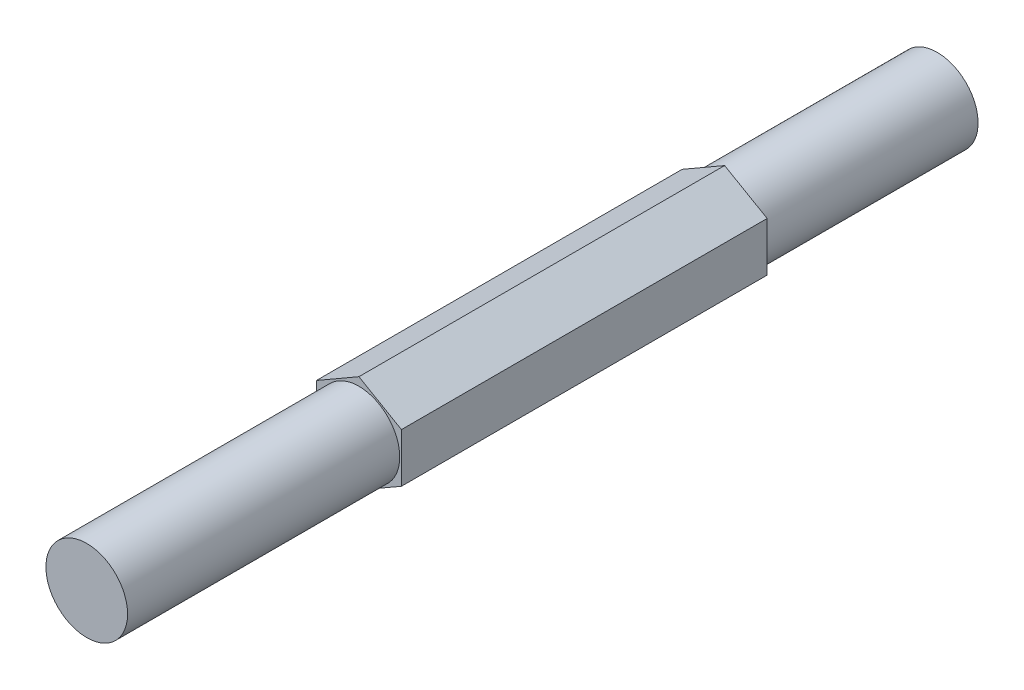
ISO-10303-21;
HEADER;
FILE_DESCRIPTION(('STEP AP214'),'2;1');
FILE_NAME('part.step','',(''),(''),'','','');
FILE_SCHEMA(('AUTOMOTIVE_DESIGN { 1 0 10303 214 1 1 1 1 }'));
ENDSEC;
DATA;
#1=APPLICATION_CONTEXT('core data for automotive mechanical design processes');
#2=APPLICATION_PROTOCOL_DEFINITION('international standard','automotive_design',2000,#1);
#3=PRODUCT_CONTEXT('',#1,'mechanical');
#4=PRODUCT('Part','Part','',(#3));
#5=PRODUCT_RELATED_PRODUCT_CATEGORY('part','',(#4));
#6=PRODUCT_DEFINITION_FORMATION('','',#4);
#7=PRODUCT_DEFINITION_CONTEXT('part definition',#1,'design');
#8=PRODUCT_DEFINITION('design','',#6,#7);
#9=PRODUCT_DEFINITION_SHAPE('','',#8);
#10=(LENGTH_UNIT() NAMED_UNIT(*) SI_UNIT(.MILLI.,.METRE.));
#11=(NAMED_UNIT(*) PLANE_ANGLE_UNIT() SI_UNIT($,.RADIAN.));
#12=(NAMED_UNIT(*) SI_UNIT($,.STERADIAN.) SOLID_ANGLE_UNIT());
#13=UNCERTAINTY_MEASURE_WITH_UNIT(LENGTH_MEASURE(1.E-05),#10,'distance_accuracy_value','');
#14=(GEOMETRIC_REPRESENTATION_CONTEXT(3) GLOBAL_UNCERTAINTY_ASSIGNED_CONTEXT((#13)) GLOBAL_UNIT_ASSIGNED_CONTEXT((#10,
#11,#12)) REPRESENTATION_CONTEXT('',''));
#15=CARTESIAN_POINT('',(0.,0.,0.));
#16=DIRECTION('',(0.,0.,1.));
#17=DIRECTION('',(1.,0.,0.));
#18=AXIS2_PLACEMENT_3D('',#15,#16,#17);
#19=CARTESIAN_POINT('',(3.17499999999998,1.83308710467707,63.5));
#20=DIRECTION('',(-0.5,-0.866025403784439,0.));
#21=DIRECTION('',(0.866025403784439,-0.5,0.));
#22=AXIS2_PLACEMENT_3D('',#19,#20,#21);
#23=PLANE('',#22);
#24=DIRECTION('',(0.866025403784439,-0.5,0.));
#25=VECTOR('',#24,1.);
#26=CARTESIAN_POINT('',(3.17499999999998,1.83308710467707,15.875));
#27=LINE('',#26,#25);
#28=CARTESIAN_POINT('',(0.,3.66617420935412,15.875));
#29=VERTEX_POINT('',#28);
#30=CARTESIAN_POINT('',(3.17499999999998,1.83308710467707,15.875));
#31=VERTEX_POINT('',#30);
#32=EDGE_CURVE('E47',#29,#31,#27,.T.);
#33=ORIENTED_EDGE('',*,*,#32,.F.);
#34=DIRECTION('',(0.,0.,-1.));
#35=VECTOR('',#34,1.);
#36=CARTESIAN_POINT('',(0.,3.66617420935412,63.5));
#37=LINE('',#36,#35);
#38=CARTESIAN_POINT('',(0.,3.66617420935412,43.18));
#39=VERTEX_POINT('',#38);
#40=EDGE_CURVE('E114',#39,#29,#37,.T.);
#41=ORIENTED_EDGE('',*,*,#40,.F.);
#42=DIRECTION('',(-0.866025403784439,0.5,0.));
#43=VECTOR('',#42,1.);
#44=CARTESIAN_POINT('',(3.17499999999998,1.83308710467707,43.18));
#45=LINE('',#44,#43);
#46=CARTESIAN_POINT('',(3.17499999999998,1.83308710467707,43.18));
#47=VERTEX_POINT('',#46);
#48=EDGE_CURVE('E105',#47,#39,#45,.T.);
#49=ORIENTED_EDGE('',*,*,#48,.F.);
#50=DIRECTION('',(0.,0.,-1.));
#51=VECTOR('',#50,1.);
#52=CARTESIAN_POINT('',(3.17499999999998,1.83308710467707,63.5));
#53=LINE('',#52,#51);
#54=EDGE_CURVE('E101',#47,#31,#53,.T.);
#55=ORIENTED_EDGE('',*,*,#54,.T.);
#56=EDGE_LOOP('',(#33,#41,#49,#55));
#57=FACE_BOUND('',#56,.T.);
#58=ADVANCED_FACE('F34',(#57),#23,.F.);
#59=CARTESIAN_POINT('',(0.,3.66617420935412,63.5));
#60=DIRECTION('',(0.499999999999999,-0.866025403784439,0.));
#61=DIRECTION('',(0.866025403784439,0.499999999999999,0.));
#62=AXIS2_PLACEMENT_3D('',#59,#60,#61);
#63=PLANE('',#62);
#64=DIRECTION('',(0.866025403784439,0.499999999999999,0.));
#65=VECTOR('',#64,1.);
#66=CARTESIAN_POINT('',(0.,3.66617420935412,15.875));
#67=LINE('',#66,#65);
#68=CARTESIAN_POINT('',(-3.17500000000001,1.83308710467706,15.875));
#69=VERTEX_POINT('',#68);
#70=EDGE_CURVE('E136',#69,#29,#67,.T.);
#71=ORIENTED_EDGE('',*,*,#70,.F.);
#72=DIRECTION('',(0.,0.,-1.));
#73=VECTOR('',#72,1.);
#74=CARTESIAN_POINT('',(-3.17500000000001,1.83308710467706,63.5));
#75=LINE('',#74,#73);
#76=CARTESIAN_POINT('',(-3.17500000000001,1.83308710467706,43.18));
#77=VERTEX_POINT('',#76);
#78=EDGE_CURVE('E111',#77,#69,#75,.T.);
#79=ORIENTED_EDGE('',*,*,#78,.F.);
#80=DIRECTION('',(-0.866025403784439,-0.499999999999999,0.));
#81=VECTOR('',#80,1.);
#82=CARTESIAN_POINT('',(0.,3.66617420935412,43.18));
#83=LINE('',#82,#81);
#84=EDGE_CURVE('E121',#39,#77,#83,.T.);
#85=ORIENTED_EDGE('',*,*,#84,.F.);
#86=ORIENTED_EDGE('',*,*,#40,.T.);
#87=EDGE_LOOP('',(#71,#79,#85,#86));
#88=FACE_BOUND('',#87,.T.);
#89=ADVANCED_FACE('F164',(#88),#63,.F.);
#90=CARTESIAN_POINT('',(-3.17500000000001,1.83308710467706,63.5));
#91=DIRECTION('',(1.,0.,0.));
#92=DIRECTION('',(0.,0.,-1.));
#93=AXIS2_PLACEMENT_3D('',#90,#91,#92);
#94=PLANE('',#93);
#95=DIRECTION('',(0.,1.,0.));
#96=VECTOR('',#95,1.);
#97=CARTESIAN_POINT('',(-3.17500000000001,1.83308710467706,15.875));
#98=LINE('',#97,#96);
#99=CARTESIAN_POINT('',(-3.17500000000001,-1.83308710467706,15.875));
#100=VERTEX_POINT('',#99);
#101=EDGE_CURVE('E138',#100,#69,#98,.T.);
#102=ORIENTED_EDGE('',*,*,#101,.F.);
#103=DIRECTION('',(0.,0.,-1.));
#104=VECTOR('',#103,1.);
#105=CARTESIAN_POINT('',(-3.17500000000001,-1.83308710467706,63.5));
#106=LINE('',#105,#104);
#107=CARTESIAN_POINT('',(-3.17500000000001,-1.83308710467706,43.18));
#108=VERTEX_POINT('',#107);
#109=EDGE_CURVE('E103',#108,#100,#106,.T.);
#110=ORIENTED_EDGE('',*,*,#109,.F.);
#111=DIRECTION('',(0.,-1.,0.));
#112=VECTOR('',#111,1.);
#113=CARTESIAN_POINT('',(-3.17500000000001,1.83308710467706,43.18));
#114=LINE('',#113,#112);
#115=EDGE_CURVE('E122',#77,#108,#114,.T.);
#116=ORIENTED_EDGE('',*,*,#115,.F.);
#117=ORIENTED_EDGE('',*,*,#78,.T.);
#118=EDGE_LOOP('',(#102,#110,#116,#117));
#119=FACE_BOUND('',#118,.T.);
#120=ADVANCED_FACE('F168',(#119),#94,.F.);
#121=CARTESIAN_POINT('',(-3.17500000000001,-1.83308710467706,63.5));
#122=DIRECTION('',(0.500000000000001,0.866025403784438,0.));
#123=DIRECTION('',(-0.866025403784438,0.500000000000001,0.));
#124=AXIS2_PLACEMENT_3D('',#121,#122,#123);
#125=PLANE('',#124);
#126=DIRECTION('',(-0.866025403784438,0.500000000000001,0.));
#127=VECTOR('',#126,1.);
#128=CARTESIAN_POINT('',(-3.17500000000001,-1.83308710467706,15.875));
#129=LINE('',#128,#127);
#130=CARTESIAN_POINT('',(0.,-3.66617420935412,15.875));
#131=VERTEX_POINT('',#130);
#132=EDGE_CURVE('E97',#131,#100,#129,.T.);
#133=ORIENTED_EDGE('',*,*,#132,.F.);
#134=DIRECTION('',(0.,0.,-1.));
#135=VECTOR('',#134,1.);
#136=CARTESIAN_POINT('',(0.,-3.66617420935412,63.5));
#137=LINE('',#136,#135);
#138=CARTESIAN_POINT('',(0.,-3.66617420935412,43.18));
#139=VERTEX_POINT('',#138);
#140=EDGE_CURVE('E96',#139,#131,#137,.T.);
#141=ORIENTED_EDGE('',*,*,#140,.F.);
#142=DIRECTION('',(0.866025403784438,-0.500000000000001,0.));
#143=VECTOR('',#142,1.);
#144=CARTESIAN_POINT('',(-3.17500000000001,-1.83308710467706,43.18));
#145=LINE('',#144,#143);
#146=EDGE_CURVE('E126',#108,#139,#145,.T.);
#147=ORIENTED_EDGE('',*,*,#146,.F.);
#148=ORIENTED_EDGE('',*,*,#109,.T.);
#149=EDGE_LOOP('',(#133,#141,#147,#148));
#150=FACE_BOUND('',#149,.T.);
#151=ADVANCED_FACE('F173',(#150),#125,.F.);
#152=CARTESIAN_POINT('',(0.,-3.66617420935412,63.5));
#153=DIRECTION('',(-0.5,0.866025403784439,0.));
#154=DIRECTION('',(-0.866025403784439,-0.5,0.));
#155=AXIS2_PLACEMENT_3D('',#152,#153,#154);
#156=PLANE('',#155);
#157=DIRECTION('',(-0.866025403784439,-0.5,0.));
#158=VECTOR('',#157,1.);
#159=CARTESIAN_POINT('',(0.,-3.66617420935412,15.875));
#160=LINE('',#159,#158);
#161=CARTESIAN_POINT('',(3.17499999999998,-1.83308710467706,15.875));
#162=VERTEX_POINT('',#161);
#163=EDGE_CURVE('E84',#162,#131,#160,.T.);
#164=ORIENTED_EDGE('',*,*,#163,.F.);
#165=DIRECTION('',(0.,0.,-1.));
#166=VECTOR('',#165,1.);
#167=CARTESIAN_POINT('',(3.17499999999998,-1.83308710467706,63.5));
#168=LINE('',#167,#166);
#169=CARTESIAN_POINT('',(3.17499999999998,-1.83308710467706,43.18));
#170=VERTEX_POINT('',#169);
#171=EDGE_CURVE('E94',#170,#162,#168,.T.);
#172=ORIENTED_EDGE('',*,*,#171,.F.);
#173=DIRECTION('',(0.866025403784439,0.5,0.));
#174=VECTOR('',#173,1.);
#175=CARTESIAN_POINT('',(0.,-3.66617420935412,43.18));
#176=LINE('',#175,#174);
#177=EDGE_CURVE('E55',#139,#170,#176,.T.);
#178=ORIENTED_EDGE('',*,*,#177,.F.);
#179=ORIENTED_EDGE('',*,*,#140,.T.);
#180=EDGE_LOOP('',(#164,#172,#178,#179));
#181=FACE_BOUND('',#180,.T.);
#182=ADVANCED_FACE('F93',(#181),#156,.F.);
#183=CARTESIAN_POINT('',(3.17499999999998,-1.83308710467706,63.5));
#184=DIRECTION('',(-1.,0.,0.));
#185=DIRECTION('',(0.,0.,1.));
#186=AXIS2_PLACEMENT_3D('',#183,#184,#185);
#187=PLANE('',#186);
#188=DIRECTION('',(0.,-1.,0.));
#189=VECTOR('',#188,1.);
#190=CARTESIAN_POINT('',(3.17499999999998,-1.83308710467706,15.875));
#191=LINE('',#190,#189);
#192=EDGE_CURVE('E12',#31,#162,#191,.T.);
#193=ORIENTED_EDGE('',*,*,#192,.F.);
#194=ORIENTED_EDGE('',*,*,#54,.F.);
#195=DIRECTION('',(0.,1.,0.));
#196=VECTOR('',#195,1.);
#197=CARTESIAN_POINT('',(3.17499999999998,-1.83308710467706,43.18));
#198=LINE('',#197,#196);
#199=EDGE_CURVE('E41',#170,#47,#198,.T.);
#200=ORIENTED_EDGE('',*,*,#199,.F.);
#201=ORIENTED_EDGE('',*,*,#171,.T.);
#202=EDGE_LOOP('',(#193,#194,#200,#201));
#203=FACE_BOUND('',#202,.T.);
#204=ADVANCED_FACE('F100',(#203),#187,.F.);
#205=CARTESIAN_POINT('',(0.,0.,43.18));
#206=DIRECTION('',(0.,0.,1.));
#207=DIRECTION('',(1.,0.,0.));
#208=AXIS2_PLACEMENT_3D('',#205,#206,#207);
#209=PLANE('',#208);
#210=CARTESIAN_POINT('',(0.,0.,43.18));
#211=DIRECTION('',(0.,0.,1.));
#212=DIRECTION('',(1.,0.,0.));
#213=AXIS2_PLACEMENT_3D('',#210,#211,#212);
#214=CIRCLE('',#213,3.048);
#215=CARTESIAN_POINT('',(3.048,0.,43.18));
#216=VERTEX_POINT('',#215);
#217=EDGE_CURVE('E129',#216,#216,#214,.T.);
#218=ORIENTED_EDGE('',*,*,#217,.F.);
#219=EDGE_LOOP('',(#218));
#220=FACE_BOUND('',#219,.T.);
#221=ORIENTED_EDGE('',*,*,#48,.T.);
#222=ORIENTED_EDGE('',*,*,#84,.T.);
#223=ORIENTED_EDGE('',*,*,#115,.T.);
#224=ORIENTED_EDGE('',*,*,#146,.T.);
#225=ORIENTED_EDGE('',*,*,#177,.T.);
#226=ORIENTED_EDGE('',*,*,#199,.T.);
#227=EDGE_LOOP('',(#221,#222,#223,#224,#225,#226));
#228=FACE_BOUND('',#227,.T.);
#229=ADVANCED_FACE('F117',(#220,#228),#209,.T.);
#230=CARTESIAN_POINT('',(0.,0.,43.18));
#231=DIRECTION('',(0.,0.,1.));
#232=DIRECTION('',(1.,0.,0.));
#233=AXIS2_PLACEMENT_3D('',#230,#231,#232);
#234=CYLINDRICAL_SURFACE('',#233,3.048);
#235=ORIENTED_EDGE('',*,*,#217,.T.);
#236=EDGE_LOOP('',(#235));
#237=FACE_BOUND('',#236,.T.);
#238=CARTESIAN_POINT('',(0.,0.,63.5));
#239=DIRECTION('',(0.,0.,1.));
#240=DIRECTION('',(1.,0.,0.));
#241=AXIS2_PLACEMENT_3D('',#238,#239,#240);
#242=CIRCLE('',#241,3.048);
#243=CARTESIAN_POINT('',(3.048,0.,63.5));
#244=VERTEX_POINT('',#243);
#245=EDGE_CURVE('E130',#244,#244,#242,.T.);
#246=ORIENTED_EDGE('',*,*,#245,.F.);
#247=EDGE_LOOP('',(#246));
#248=FACE_BOUND('',#247,.T.);
#249=ADVANCED_FACE('F159',(#237,#248),#234,.T.);
#250=CARTESIAN_POINT('',(0.,0.,63.5));
#251=DIRECTION('',(0.,0.,1.));
#252=DIRECTION('',(1.,0.,0.));
#253=AXIS2_PLACEMENT_3D('',#250,#251,#252);
#254=PLANE('',#253);
#255=ORIENTED_EDGE('',*,*,#245,.T.);
#256=EDGE_LOOP('',(#255));
#257=FACE_BOUND('',#256,.T.);
#258=ADVANCED_FACE('F151',(#257),#254,.T.);
#259=CARTESIAN_POINT('',(0.,0.,15.875));
#260=DIRECTION('',(0.,0.,-1.));
#261=DIRECTION('',(-1.,0.,0.));
#262=AXIS2_PLACEMENT_3D('',#259,#260,#261);
#263=PLANE('',#262);
#264=CARTESIAN_POINT('',(0.,0.,15.875));
#265=DIRECTION('',(0.,0.,-1.));
#266=DIRECTION('',(-1.,0.,0.));
#267=AXIS2_PLACEMENT_3D('',#264,#265,#266);
#268=CIRCLE('',#267,3.048);
#269=CARTESIAN_POINT('',(-3.048,0.,15.875));
#270=VERTEX_POINT('',#269);
#271=EDGE_CURVE('E98',#270,#270,#268,.T.);
#272=ORIENTED_EDGE('',*,*,#271,.F.);
#273=EDGE_LOOP('',(#272));
#274=FACE_BOUND('',#273,.T.);
#275=ORIENTED_EDGE('',*,*,#32,.T.);
#276=ORIENTED_EDGE('',*,*,#192,.T.);
#277=ORIENTED_EDGE('',*,*,#163,.T.);
#278=ORIENTED_EDGE('',*,*,#132,.T.);
#279=ORIENTED_EDGE('',*,*,#101,.T.);
#280=ORIENTED_EDGE('',*,*,#70,.T.);
#281=EDGE_LOOP('',(#275,#276,#277,#278,#279,#280));
#282=FACE_BOUND('',#281,.T.);
#283=ADVANCED_FACE('F83',(#274,#282),#263,.T.);
#284=CARTESIAN_POINT('',(0.,0.,15.875));
#285=DIRECTION('',(0.,0.,-1.));
#286=DIRECTION('',(-1.,0.,0.));
#287=AXIS2_PLACEMENT_3D('',#284,#285,#286);
#288=CYLINDRICAL_SURFACE('',#287,3.048);
#289=ORIENTED_EDGE('',*,*,#271,.T.);
#290=EDGE_LOOP('',(#289));
#291=FACE_BOUND('',#290,.T.);
#292=CARTESIAN_POINT('',(0.,0.,0.));
#293=DIRECTION('',(0.,0.,-1.));
#294=DIRECTION('',(-1.,0.,0.));
#295=AXIS2_PLACEMENT_3D('',#292,#293,#294);
#296=CIRCLE('',#295,3.048);
#297=CARTESIAN_POINT('',(-3.048,0.,0.));
#298=VERTEX_POINT('',#297);
#299=EDGE_CURVE('E141',#298,#298,#296,.T.);
#300=ORIENTED_EDGE('',*,*,#299,.F.);
#301=EDGE_LOOP('',(#300));
#302=FACE_BOUND('',#301,.T.);
#303=ADVANCED_FACE('F147',(#291,#302),#288,.T.);
#304=CARTESIAN_POINT('',(0.,0.,0.));
#305=DIRECTION('',(0.,0.,1.));
#306=DIRECTION('',(1.,0.,0.));
#307=AXIS2_PLACEMENT_3D('',#304,#305,#306);
#308=PLANE('',#307);
#309=ORIENTED_EDGE('',*,*,#299,.T.);
#310=EDGE_LOOP('',(#309));
#311=FACE_BOUND('',#310,.T.);
#312=ADVANCED_FACE('F157',(#311),#308,.F.);
#313=CLOSED_SHELL('',(#58,#89,#120,#151,#182,#204,#229,#249,#258,#283,#303,#312));
#314=MANIFOLD_SOLID_BREP('B2',#313);
#315=ADVANCED_BREP_SHAPE_REPRESENTATION('',(#18,#314),#14);
#316=SHAPE_DEFINITION_REPRESENTATION(#9,#315);
ENDSEC;
END-ISO-10303-21;
